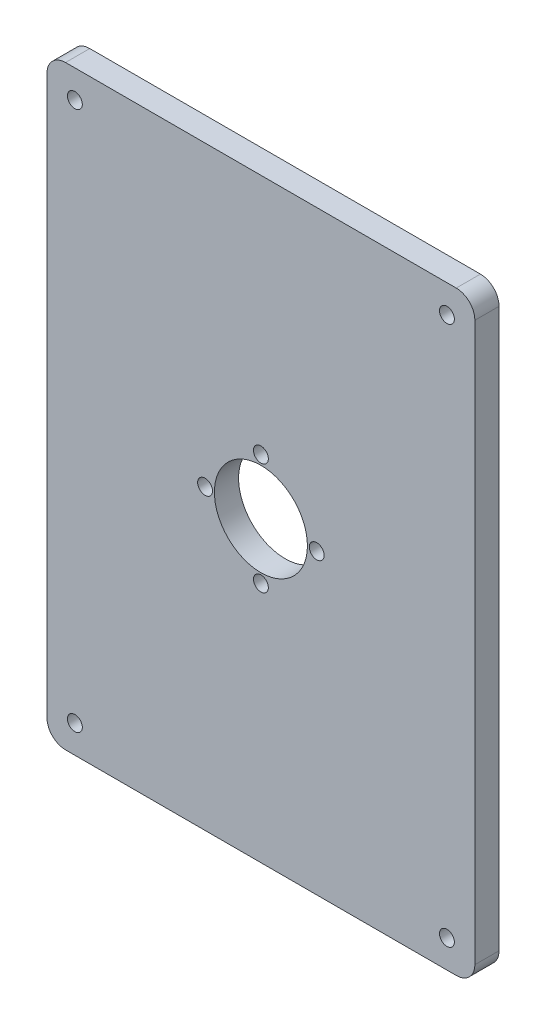
ISO-10303-21;
HEADER;
FILE_DESCRIPTION(('STEP AP214'),'2;1');
FILE_NAME('part.step','',(''),(''),'','','');
FILE_SCHEMA(('AUTOMOTIVE_DESIGN { 1 0 10303 214 1 1 1 1 }'));
ENDSEC;
DATA;
#1=APPLICATION_CONTEXT('core data for automotive mechanical design processes');
#2=APPLICATION_PROTOCOL_DEFINITION('international standard','automotive_design',2000,#1);
#3=PRODUCT_CONTEXT('',#1,'mechanical');
#4=PRODUCT('Part','Part','',(#3));
#5=PRODUCT_RELATED_PRODUCT_CATEGORY('part','',(#4));
#6=PRODUCT_DEFINITION_FORMATION('','',#4);
#7=PRODUCT_DEFINITION_CONTEXT('part definition',#1,'design');
#8=PRODUCT_DEFINITION('design','',#6,#7);
#9=PRODUCT_DEFINITION_SHAPE('','',#8);
#10=(LENGTH_UNIT() NAMED_UNIT(*) SI_UNIT(.MILLI.,.METRE.));
#11=(NAMED_UNIT(*) PLANE_ANGLE_UNIT() SI_UNIT($,.RADIAN.));
#12=(NAMED_UNIT(*) SI_UNIT($,.STERADIAN.) SOLID_ANGLE_UNIT());
#13=UNCERTAINTY_MEASURE_WITH_UNIT(LENGTH_MEASURE(1.E-05),#10,'distance_accuracy_value','');
#14=(GEOMETRIC_REPRESENTATION_CONTEXT(3) GLOBAL_UNCERTAINTY_ASSIGNED_CONTEXT((#13)) GLOBAL_UNIT_ASSIGNED_CONTEXT((#10,
#11,#12)) REPRESENTATION_CONTEXT('',''));
#15=CARTESIAN_POINT('',(0.,0.,0.));
#16=DIRECTION('',(0.,0.,1.));
#17=DIRECTION('',(1.,0.,0.));
#18=AXIS2_PLACEMENT_3D('',#15,#16,#17);
#19=CARTESIAN_POINT('',(105.,150.,13.));
#20=DIRECTION('',(0.,0.,-1.));
#21=DIRECTION('',(-1.,0.,0.));
#22=AXIS2_PLACEMENT_3D('',#19,#20,#21);
#23=PLANE('',#22);
#24=CARTESIAN_POINT('',(-30.,0.,13.));
#25=DIRECTION('',(0.,0.,1.));
#26=DIRECTION('',(1.,0.,0.));
#27=AXIS2_PLACEMENT_3D('',#24,#25,#26);
#28=CIRCLE('',#27,4.);
#29=CARTESIAN_POINT('',(-26.,0.,13.));
#30=VERTEX_POINT('',#29);
#31=EDGE_CURVE('E228',#30,#30,#28,.T.);
#32=ORIENTED_EDGE('',*,*,#31,.F.);
#33=EDGE_LOOP('',(#32));
#34=FACE_BOUND('',#33,.T.);
#35=CARTESIAN_POINT('',(0.,30.,13.));
#36=DIRECTION('',(0.,0.,1.));
#37=DIRECTION('',(1.,0.,0.));
#38=AXIS2_PLACEMENT_3D('',#35,#36,#37);
#39=CIRCLE('',#38,4.);
#40=CARTESIAN_POINT('',(4.,30.,13.));
#41=VERTEX_POINT('',#40);
#42=EDGE_CURVE('E225',#41,#41,#39,.T.);
#43=ORIENTED_EDGE('',*,*,#42,.F.);
#44=EDGE_LOOP('',(#43));
#45=FACE_BOUND('',#44,.T.);
#46=CARTESIAN_POINT('',(30.,0.,13.));
#47=DIRECTION('',(0.,0.,1.));
#48=DIRECTION('',(1.,0.,0.));
#49=AXIS2_PLACEMENT_3D('',#46,#47,#48);
#50=CIRCLE('',#49,4.00000000000001);
#51=CARTESIAN_POINT('',(34.,0.,13.));
#52=VERTEX_POINT('',#51);
#53=EDGE_CURVE('E219',#52,#52,#50,.T.);
#54=ORIENTED_EDGE('',*,*,#53,.F.);
#55=EDGE_LOOP('',(#54));
#56=FACE_BOUND('',#55,.T.);
#57=CARTESIAN_POINT('',(0.,-30.,13.));
#58=DIRECTION('',(0.,0.,1.));
#59=DIRECTION('',(1.,0.,0.));
#60=AXIS2_PLACEMENT_3D('',#57,#58,#59);
#61=CIRCLE('',#60,4.);
#62=CARTESIAN_POINT('',(4.,-30.,13.));
#63=VERTEX_POINT('',#62);
#64=EDGE_CURVE('E213',#63,#63,#61,.T.);
#65=ORIENTED_EDGE('',*,*,#64,.F.);
#66=EDGE_LOOP('',(#65));
#67=FACE_BOUND('',#66,.T.);
#68=CARTESIAN_POINT('',(0.,0.,13.));
#69=DIRECTION('',(0.,0.,1.));
#70=DIRECTION('',(1.,0.,0.));
#71=AXIS2_PLACEMENT_3D('',#68,#69,#70);
#72=CIRCLE('',#71,25.);
#73=CARTESIAN_POINT('',(25.,0.,13.));
#74=VERTEX_POINT('',#73);
#75=EDGE_CURVE('E204',#74,#74,#72,.T.);
#76=ORIENTED_EDGE('',*,*,#75,.F.);
#77=EDGE_LOOP('',(#76));
#78=FACE_BOUND('',#77,.T.);
#79=CARTESIAN_POINT('',(105.,150.,13.));
#80=DIRECTION('',(0.,0.,1.));
#81=DIRECTION('',(-1.,0.,0.));
#82=AXIS2_PLACEMENT_3D('',#79,#80,#81);
#83=CIRCLE('',#82,10.);
#84=CARTESIAN_POINT('',(115.,150.,13.));
#85=VERTEX_POINT('',#84);
#86=CARTESIAN_POINT('',(105.,160.,13.));
#87=VERTEX_POINT('',#86);
#88=EDGE_CURVE('E146',#85,#87,#83,.T.);
#89=ORIENTED_EDGE('',*,*,#88,.T.);
#90=DIRECTION('',(-1.,0.,0.));
#91=VECTOR('',#90,1.);
#92=CARTESIAN_POINT('',(-105.,160.,13.));
#93=LINE('',#92,#91);
#94=CARTESIAN_POINT('',(-105.,160.,13.));
#95=VERTEX_POINT('',#94);
#96=EDGE_CURVE('E94',#87,#95,#93,.T.);
#97=ORIENTED_EDGE('',*,*,#96,.T.);
#98=CARTESIAN_POINT('',(-105.,150.,13.));
#99=DIRECTION('',(0.,0.,1.));
#100=DIRECTION('',(1.,0.,0.));
#101=AXIS2_PLACEMENT_3D('',#98,#99,#100);
#102=CIRCLE('',#101,10.);
#103=CARTESIAN_POINT('',(-115.,150.,13.));
#104=VERTEX_POINT('',#103);
#105=EDGE_CURVE('E161',#95,#104,#102,.T.);
#106=ORIENTED_EDGE('',*,*,#105,.T.);
#107=DIRECTION('',(0.,-1.,0.));
#108=VECTOR('',#107,1.);
#109=CARTESIAN_POINT('',(-115.,150.,13.));
#110=LINE('',#109,#108);
#111=CARTESIAN_POINT('',(-115.,-150.,13.));
#112=VERTEX_POINT('',#111);
#113=EDGE_CURVE('E174',#104,#112,#110,.T.);
#114=ORIENTED_EDGE('',*,*,#113,.T.);
#115=CARTESIAN_POINT('',(-105.,-150.,13.));
#116=DIRECTION('',(0.,0.,1.));
#117=DIRECTION('',(1.,0.,0.));
#118=AXIS2_PLACEMENT_3D('',#115,#116,#117);
#119=CIRCLE('',#118,10.);
#120=CARTESIAN_POINT('',(-105.,-160.,13.));
#121=VERTEX_POINT('',#120);
#122=EDGE_CURVE('E113',#112,#121,#119,.T.);
#123=ORIENTED_EDGE('',*,*,#122,.T.);
#124=DIRECTION('',(1.,0.,0.));
#125=VECTOR('',#124,1.);
#126=CARTESIAN_POINT('',(-105.,-160.,13.));
#127=LINE('',#126,#125);
#128=CARTESIAN_POINT('',(105.,-160.,13.));
#129=VERTEX_POINT('',#128);
#130=EDGE_CURVE('E107',#121,#129,#127,.T.);
#131=ORIENTED_EDGE('',*,*,#130,.T.);
#132=CARTESIAN_POINT('',(105.,-150.,13.));
#133=DIRECTION('',(0.,0.,1.));
#134=DIRECTION('',(1.,0.,0.));
#135=AXIS2_PLACEMENT_3D('',#132,#133,#134);
#136=CIRCLE('',#135,10.);
#137=CARTESIAN_POINT('',(115.,-150.,13.));
#138=VERTEX_POINT('',#137);
#139=EDGE_CURVE('E111',#129,#138,#136,.T.);
#140=ORIENTED_EDGE('',*,*,#139,.T.);
#141=DIRECTION('',(0.,1.,0.));
#142=VECTOR('',#141,1.);
#143=CARTESIAN_POINT('',(115.,150.,13.));
#144=LINE('',#143,#142);
#145=EDGE_CURVE('E51',#138,#85,#144,.T.);
#146=ORIENTED_EDGE('',*,*,#145,.T.);
#147=EDGE_LOOP('',(#89,#97,#106,#114,#123,#131,#140,#146));
#148=FACE_BOUND('',#147,.T.);
#149=CARTESIAN_POINT('',(-100.,-145.,13.));
#150=DIRECTION('',(0.,0.,1.));
#151=DIRECTION('',(1.,0.,0.));
#152=AXIS2_PLACEMENT_3D('',#149,#150,#151);
#153=CIRCLE('',#152,4.00000000000001);
#154=CARTESIAN_POINT('',(-96.,-145.,13.));
#155=VERTEX_POINT('',#154);
#156=EDGE_CURVE('E135',#155,#155,#153,.T.);
#157=ORIENTED_EDGE('',*,*,#156,.F.);
#158=EDGE_LOOP('',(#157));
#159=FACE_BOUND('',#158,.T.);
#160=CARTESIAN_POINT('',(-100.,145.,13.));
#161=DIRECTION('',(0.,0.,1.));
#162=DIRECTION('',(1.,0.,0.));
#163=AXIS2_PLACEMENT_3D('',#160,#161,#162);
#164=CIRCLE('',#163,4.00000000000001);
#165=CARTESIAN_POINT('',(-96.,145.,13.));
#166=VERTEX_POINT('',#165);
#167=EDGE_CURVE('E183',#166,#166,#164,.T.);
#168=ORIENTED_EDGE('',*,*,#167,.F.);
#169=EDGE_LOOP('',(#168));
#170=FACE_BOUND('',#169,.T.);
#171=CARTESIAN_POINT('',(100.,-145.,13.));
#172=DIRECTION('',(0.,0.,1.));
#173=DIRECTION('',(1.,0.,0.));
#174=AXIS2_PLACEMENT_3D('',#171,#172,#173);
#175=CIRCLE('',#174,4.00000000000001);
#176=CARTESIAN_POINT('',(104.,-145.,13.));
#177=VERTEX_POINT('',#176);
#178=EDGE_CURVE('E189',#177,#177,#175,.T.);
#179=ORIENTED_EDGE('',*,*,#178,.F.);
#180=EDGE_LOOP('',(#179));
#181=FACE_BOUND('',#180,.T.);
#182=CARTESIAN_POINT('',(100.,145.,13.));
#183=DIRECTION('',(0.,0.,1.));
#184=DIRECTION('',(1.,0.,0.));
#185=AXIS2_PLACEMENT_3D('',#182,#183,#184);
#186=CIRCLE('',#185,4.00000000000001);
#187=CARTESIAN_POINT('',(104.,145.,13.));
#188=VERTEX_POINT('',#187);
#189=EDGE_CURVE('E195',#188,#188,#186,.T.);
#190=ORIENTED_EDGE('',*,*,#189,.F.);
#191=EDGE_LOOP('',(#190));
#192=FACE_BOUND('',#191,.T.);
#193=ADVANCED_FACE('F34',(#34,#45,#56,#67,#78,#148,#159,#170,#181,#192),#23,.F.);
#194=CARTESIAN_POINT('',(105.,150.,0.));
#195=DIRECTION('',(0.,0.,-1.));
#196=DIRECTION('',(-1.,0.,0.));
#197=AXIS2_PLACEMENT_3D('',#194,#195,#196);
#198=PLANE('',#197);
#199=CARTESIAN_POINT('',(-30.,0.,0.));
#200=DIRECTION('',(0.,0.,1.));
#201=DIRECTION('',(1.,0.,0.));
#202=AXIS2_PLACEMENT_3D('',#199,#200,#201);
#203=CIRCLE('',#202,4.);
#204=CARTESIAN_POINT('',(-26.,0.,0.));
#205=VERTEX_POINT('',#204);
#206=EDGE_CURVE('E207',#205,#205,#203,.T.);
#207=ORIENTED_EDGE('',*,*,#206,.T.);
#208=EDGE_LOOP('',(#207));
#209=FACE_BOUND('',#208,.T.);
#210=CARTESIAN_POINT('',(0.,30.,0.));
#211=DIRECTION('',(0.,0.,1.));
#212=DIRECTION('',(1.,0.,0.));
#213=AXIS2_PLACEMENT_3D('',#210,#211,#212);
#214=CIRCLE('',#213,4.);
#215=CARTESIAN_POINT('',(4.,30.,0.));
#216=VERTEX_POINT('',#215);
#217=EDGE_CURVE('E222',#216,#216,#214,.T.);
#218=ORIENTED_EDGE('',*,*,#217,.T.);
#219=EDGE_LOOP('',(#218));
#220=FACE_BOUND('',#219,.T.);
#221=CARTESIAN_POINT('',(30.,0.,0.));
#222=DIRECTION('',(0.,0.,1.));
#223=DIRECTION('',(1.,0.,0.));
#224=AXIS2_PLACEMENT_3D('',#221,#222,#223);
#225=CIRCLE('',#224,4.00000000000001);
#226=CARTESIAN_POINT('',(34.,0.,0.));
#227=VERTEX_POINT('',#226);
#228=EDGE_CURVE('E216',#227,#227,#225,.T.);
#229=ORIENTED_EDGE('',*,*,#228,.T.);
#230=EDGE_LOOP('',(#229));
#231=FACE_BOUND('',#230,.T.);
#232=CARTESIAN_POINT('',(0.,-30.,0.));
#233=DIRECTION('',(0.,0.,1.));
#234=DIRECTION('',(1.,0.,0.));
#235=AXIS2_PLACEMENT_3D('',#232,#233,#234);
#236=CIRCLE('',#235,4.);
#237=CARTESIAN_POINT('',(4.,-30.,0.));
#238=VERTEX_POINT('',#237);
#239=EDGE_CURVE('E210',#238,#238,#236,.T.);
#240=ORIENTED_EDGE('',*,*,#239,.T.);
#241=EDGE_LOOP('',(#240));
#242=FACE_BOUND('',#241,.T.);
#243=CARTESIAN_POINT('',(0.,0.,0.));
#244=DIRECTION('',(0.,0.,1.));
#245=DIRECTION('',(1.,0.,0.));
#246=AXIS2_PLACEMENT_3D('',#243,#244,#245);
#247=CIRCLE('',#246,25.);
#248=CARTESIAN_POINT('',(25.,0.,0.));
#249=VERTEX_POINT('',#248);
#250=EDGE_CURVE('E201',#249,#249,#247,.T.);
#251=ORIENTED_EDGE('',*,*,#250,.T.);
#252=EDGE_LOOP('',(#251));
#253=FACE_BOUND('',#252,.T.);
#254=CARTESIAN_POINT('',(100.,-145.,0.));
#255=DIRECTION('',(0.,0.,1.));
#256=DIRECTION('',(1.,0.,0.));
#257=AXIS2_PLACEMENT_3D('',#254,#255,#256);
#258=CIRCLE('',#257,4.00000000000001);
#259=CARTESIAN_POINT('',(104.,-145.,0.));
#260=VERTEX_POINT('',#259);
#261=EDGE_CURVE('E192',#260,#260,#258,.T.);
#262=ORIENTED_EDGE('',*,*,#261,.T.);
#263=EDGE_LOOP('',(#262));
#264=FACE_BOUND('',#263,.T.);
#265=CARTESIAN_POINT('',(-100.,-145.,0.));
#266=DIRECTION('',(0.,0.,1.));
#267=DIRECTION('',(1.,0.,0.));
#268=AXIS2_PLACEMENT_3D('',#265,#266,#267);
#269=CIRCLE('',#268,4.00000000000001);
#270=CARTESIAN_POINT('',(-96.,-145.,0.));
#271=VERTEX_POINT('',#270);
#272=EDGE_CURVE('E180',#271,#271,#269,.T.);
#273=ORIENTED_EDGE('',*,*,#272,.T.);
#274=EDGE_LOOP('',(#273));
#275=FACE_BOUND('',#274,.T.);
#276=CARTESIAN_POINT('',(105.,150.,0.));
#277=DIRECTION('',(0.,0.,1.));
#278=DIRECTION('',(-1.,0.,0.));
#279=AXIS2_PLACEMENT_3D('',#276,#277,#278);
#280=CIRCLE('',#279,10.);
#281=CARTESIAN_POINT('',(115.,150.,0.));
#282=VERTEX_POINT('',#281);
#283=CARTESIAN_POINT('',(105.,160.,0.));
#284=VERTEX_POINT('',#283);
#285=EDGE_CURVE('E131',#282,#284,#280,.T.);
#286=ORIENTED_EDGE('',*,*,#285,.F.);
#287=DIRECTION('',(0.,1.,0.));
#288=VECTOR('',#287,1.);
#289=CARTESIAN_POINT('',(115.,150.,0.));
#290=LINE('',#289,#288);
#291=CARTESIAN_POINT('',(115.,-150.,0.));
#292=VERTEX_POINT('',#291);
#293=EDGE_CURVE('E86',#292,#282,#290,.T.);
#294=ORIENTED_EDGE('',*,*,#293,.F.);
#295=CARTESIAN_POINT('',(105.,-150.,0.));
#296=DIRECTION('',(0.,0.,1.));
#297=DIRECTION('',(1.,0.,0.));
#298=AXIS2_PLACEMENT_3D('',#295,#296,#297);
#299=CIRCLE('',#298,10.);
#300=CARTESIAN_POINT('',(105.,-160.,0.));
#301=VERTEX_POINT('',#300);
#302=EDGE_CURVE('E80',#301,#292,#299,.T.);
#303=ORIENTED_EDGE('',*,*,#302,.F.);
#304=DIRECTION('',(1.,0.,0.));
#305=VECTOR('',#304,1.);
#306=CARTESIAN_POINT('',(-105.,-160.,0.));
#307=LINE('',#306,#305);
#308=CARTESIAN_POINT('',(-105.,-160.,0.));
#309=VERTEX_POINT('',#308);
#310=EDGE_CURVE('E121',#309,#301,#307,.T.);
#311=ORIENTED_EDGE('',*,*,#310,.F.);
#312=CARTESIAN_POINT('',(-105.,-150.,0.));
#313=DIRECTION('',(0.,0.,1.));
#314=DIRECTION('',(1.,0.,0.));
#315=AXIS2_PLACEMENT_3D('',#312,#313,#314);
#316=CIRCLE('',#315,10.);
#317=CARTESIAN_POINT('',(-115.,-150.,0.));
#318=VERTEX_POINT('',#317);
#319=EDGE_CURVE('E141',#318,#309,#316,.T.);
#320=ORIENTED_EDGE('',*,*,#319,.F.);
#321=DIRECTION('',(0.,-1.,0.));
#322=VECTOR('',#321,1.);
#323=CARTESIAN_POINT('',(-115.,150.,0.));
#324=LINE('',#323,#322);
#325=CARTESIAN_POINT('',(-115.,150.,0.));
#326=VERTEX_POINT('',#325);
#327=EDGE_CURVE('E139',#326,#318,#324,.T.);
#328=ORIENTED_EDGE('',*,*,#327,.F.);
#329=CARTESIAN_POINT('',(-105.,150.,0.));
#330=DIRECTION('',(0.,0.,1.));
#331=DIRECTION('',(1.,0.,0.));
#332=AXIS2_PLACEMENT_3D('',#329,#330,#331);
#333=CIRCLE('',#332,10.);
#334=CARTESIAN_POINT('',(-105.,160.,0.));
#335=VERTEX_POINT('',#334);
#336=EDGE_CURVE('E137',#335,#326,#333,.T.);
#337=ORIENTED_EDGE('',*,*,#336,.F.);
#338=DIRECTION('',(-1.,0.,0.));
#339=VECTOR('',#338,1.);
#340=CARTESIAN_POINT('',(-105.,160.,0.));
#341=LINE('',#340,#339);
#342=EDGE_CURVE('E134',#284,#335,#341,.T.);
#343=ORIENTED_EDGE('',*,*,#342,.F.);
#344=EDGE_LOOP('',(#286,#294,#303,#311,#320,#328,#337,#343));
#345=FACE_BOUND('',#344,.T.);
#346=CARTESIAN_POINT('',(-100.,145.,0.));
#347=DIRECTION('',(0.,0.,1.));
#348=DIRECTION('',(1.,0.,0.));
#349=AXIS2_PLACEMENT_3D('',#346,#347,#348);
#350=CIRCLE('',#349,4.00000000000001);
#351=CARTESIAN_POINT('',(-96.,145.,0.));
#352=VERTEX_POINT('',#351);
#353=EDGE_CURVE('E186',#352,#352,#350,.T.);
#354=ORIENTED_EDGE('',*,*,#353,.T.);
#355=EDGE_LOOP('',(#354));
#356=FACE_BOUND('',#355,.T.);
#357=CARTESIAN_POINT('',(100.,145.,0.));
#358=DIRECTION('',(0.,0.,1.));
#359=DIRECTION('',(1.,0.,0.));
#360=AXIS2_PLACEMENT_3D('',#357,#358,#359);
#361=CIRCLE('',#360,4.00000000000001);
#362=CARTESIAN_POINT('',(104.,145.,0.));
#363=VERTEX_POINT('',#362);
#364=EDGE_CURVE('E198',#363,#363,#361,.T.);
#365=ORIENTED_EDGE('',*,*,#364,.T.);
#366=EDGE_LOOP('',(#365));
#367=FACE_BOUND('',#366,.T.);
#368=ADVANCED_FACE('F165',(#209,#220,#231,#242,#253,#264,#275,#345,#356,#367),#198,.T.);
#369=CARTESIAN_POINT('',(105.,150.,13.));
#370=DIRECTION('',(0.,0.,-1.));
#371=DIRECTION('',(-1.,0.,0.));
#372=AXIS2_PLACEMENT_3D('',#369,#370,#371);
#373=CYLINDRICAL_SURFACE('',#372,10.);
#374=ORIENTED_EDGE('',*,*,#285,.T.);
#375=DIRECTION('',(0.,0.,-1.));
#376=VECTOR('',#375,1.);
#377=CARTESIAN_POINT('',(105.,160.,13.));
#378=LINE('',#377,#376);
#379=EDGE_CURVE('E11',#87,#284,#378,.T.);
#380=ORIENTED_EDGE('',*,*,#379,.F.);
#381=ORIENTED_EDGE('',*,*,#88,.F.);
#382=DIRECTION('',(0.,0.,-1.));
#383=VECTOR('',#382,1.);
#384=CARTESIAN_POINT('',(115.,150.,13.));
#385=LINE('',#384,#383);
#386=EDGE_CURVE('E127',#85,#282,#385,.T.);
#387=ORIENTED_EDGE('',*,*,#386,.T.);
#388=EDGE_LOOP('',(#374,#380,#381,#387));
#389=FACE_BOUND('',#388,.T.);
#390=ADVANCED_FACE('F36',(#389),#373,.T.);
#391=CARTESIAN_POINT('',(-105.,160.,13.));
#392=DIRECTION('',(0.,-1.,0.));
#393=DIRECTION('',(0.,0.,-1.));
#394=AXIS2_PLACEMENT_3D('',#391,#392,#393);
#395=PLANE('',#394);
#396=ORIENTED_EDGE('',*,*,#342,.T.);
#397=DIRECTION('',(0.,0.,-1.));
#398=VECTOR('',#397,1.);
#399=CARTESIAN_POINT('',(-105.,160.,13.));
#400=LINE('',#399,#398);
#401=EDGE_CURVE('E43',#95,#335,#400,.T.);
#402=ORIENTED_EDGE('',*,*,#401,.F.);
#403=ORIENTED_EDGE('',*,*,#96,.F.);
#404=ORIENTED_EDGE('',*,*,#379,.T.);
#405=EDGE_LOOP('',(#396,#402,#403,#404));
#406=FACE_BOUND('',#405,.T.);
#407=ADVANCED_FACE('F298',(#406),#395,.F.);
#408=CARTESIAN_POINT('',(-105.,150.,13.));
#409=DIRECTION('',(0.,0.,-1.));
#410=DIRECTION('',(-1.,0.,0.));
#411=AXIS2_PLACEMENT_3D('',#408,#409,#410);
#412=CYLINDRICAL_SURFACE('',#411,10.);
#413=ORIENTED_EDGE('',*,*,#336,.T.);
#414=DIRECTION('',(0.,0.,-1.));
#415=VECTOR('',#414,1.);
#416=CARTESIAN_POINT('',(-115.,150.,13.));
#417=LINE('',#416,#415);
#418=EDGE_CURVE('E153',#104,#326,#417,.T.);
#419=ORIENTED_EDGE('',*,*,#418,.F.);
#420=ORIENTED_EDGE('',*,*,#105,.F.);
#421=ORIENTED_EDGE('',*,*,#401,.T.);
#422=EDGE_LOOP('',(#413,#419,#420,#421));
#423=FACE_BOUND('',#422,.T.);
#424=ADVANCED_FACE('F159',(#423),#412,.T.);
#425=CARTESIAN_POINT('',(-115.,150.,13.));
#426=DIRECTION('',(1.,0.,0.));
#427=DIRECTION('',(0.,1.,0.));
#428=AXIS2_PLACEMENT_3D('',#425,#426,#427);
#429=PLANE('',#428);
#430=ORIENTED_EDGE('',*,*,#327,.T.);
#431=DIRECTION('',(0.,0.,-1.));
#432=VECTOR('',#431,1.);
#433=CARTESIAN_POINT('',(-115.,-150.,13.));
#434=LINE('',#433,#432);
#435=EDGE_CURVE('E150',#112,#318,#434,.T.);
#436=ORIENTED_EDGE('',*,*,#435,.F.);
#437=ORIENTED_EDGE('',*,*,#113,.F.);
#438=ORIENTED_EDGE('',*,*,#418,.T.);
#439=EDGE_LOOP('',(#430,#436,#437,#438));
#440=FACE_BOUND('',#439,.T.);
#441=ADVANCED_FACE('F170',(#440),#429,.F.);
#442=CARTESIAN_POINT('',(-105.,-150.,13.));
#443=DIRECTION('',(0.,0.,-1.));
#444=DIRECTION('',(-1.,0.,0.));
#445=AXIS2_PLACEMENT_3D('',#442,#443,#444);
#446=CYLINDRICAL_SURFACE('',#445,10.);
#447=ORIENTED_EDGE('',*,*,#319,.T.);
#448=DIRECTION('',(0.,0.,-1.));
#449=VECTOR('',#448,1.);
#450=CARTESIAN_POINT('',(-105.,-160.,13.));
#451=LINE('',#450,#449);
#452=EDGE_CURVE('E122',#121,#309,#451,.T.);
#453=ORIENTED_EDGE('',*,*,#452,.F.);
#454=ORIENTED_EDGE('',*,*,#122,.F.);
#455=ORIENTED_EDGE('',*,*,#435,.T.);
#456=EDGE_LOOP('',(#447,#453,#454,#455));
#457=FACE_BOUND('',#456,.T.);
#458=ADVANCED_FACE('F173',(#457),#446,.T.);
#459=CARTESIAN_POINT('',(-105.,-160.,13.));
#460=DIRECTION('',(0.,1.,0.));
#461=DIRECTION('',(0.,0.,1.));
#462=AXIS2_PLACEMENT_3D('',#459,#460,#461);
#463=PLANE('',#462);
#464=ORIENTED_EDGE('',*,*,#310,.T.);
#465=DIRECTION('',(0.,0.,-1.));
#466=VECTOR('',#465,1.);
#467=CARTESIAN_POINT('',(105.,-160.,13.));
#468=LINE('',#467,#466);
#469=EDGE_CURVE('E118',#129,#301,#468,.T.);
#470=ORIENTED_EDGE('',*,*,#469,.F.);
#471=ORIENTED_EDGE('',*,*,#130,.F.);
#472=ORIENTED_EDGE('',*,*,#452,.T.);
#473=EDGE_LOOP('',(#464,#470,#471,#472));
#474=FACE_BOUND('',#473,.T.);
#475=ADVANCED_FACE('F119',(#474),#463,.F.);
#476=CARTESIAN_POINT('',(105.,-150.,13.));
#477=DIRECTION('',(0.,0.,-1.));
#478=DIRECTION('',(-1.,0.,0.));
#479=AXIS2_PLACEMENT_3D('',#476,#477,#478);
#480=CYLINDRICAL_SURFACE('',#479,10.);
#481=ORIENTED_EDGE('',*,*,#302,.T.);
#482=DIRECTION('',(0.,0.,-1.));
#483=VECTOR('',#482,1.);
#484=CARTESIAN_POINT('',(115.,-150.,13.));
#485=LINE('',#484,#483);
#486=EDGE_CURVE('E123',#138,#292,#485,.T.);
#487=ORIENTED_EDGE('',*,*,#486,.F.);
#488=ORIENTED_EDGE('',*,*,#139,.F.);
#489=ORIENTED_EDGE('',*,*,#469,.T.);
#490=EDGE_LOOP('',(#481,#487,#488,#489));
#491=FACE_BOUND('',#490,.T.);
#492=ADVANCED_FACE('F125',(#491),#480,.T.);
#493=CARTESIAN_POINT('',(115.,150.,13.));
#494=DIRECTION('',(-1.,0.,0.));
#495=DIRECTION('',(0.,-1.,0.));
#496=AXIS2_PLACEMENT_3D('',#493,#494,#495);
#497=PLANE('',#496);
#498=ORIENTED_EDGE('',*,*,#293,.T.);
#499=ORIENTED_EDGE('',*,*,#386,.F.);
#500=ORIENTED_EDGE('',*,*,#145,.F.);
#501=ORIENTED_EDGE('',*,*,#486,.T.);
#502=EDGE_LOOP('',(#498,#499,#500,#501));
#503=FACE_BOUND('',#502,.T.);
#504=ADVANCED_FACE('F282',(#503),#497,.F.);
#505=CARTESIAN_POINT('',(-100.,-145.,13.));
#506=DIRECTION('',(0.,0.,-1.));
#507=DIRECTION('',(-1.,0.,0.));
#508=AXIS2_PLACEMENT_3D('',#505,#506,#507);
#509=CYLINDRICAL_SURFACE('',#508,4.00000000000001);
#510=ORIENTED_EDGE('',*,*,#156,.T.);
#511=EDGE_LOOP('',(#510));
#512=FACE_BOUND('',#511,.T.);
#513=ORIENTED_EDGE('',*,*,#272,.F.);
#514=EDGE_LOOP('',(#513));
#515=FACE_BOUND('',#514,.T.);
#516=ADVANCED_FACE('F279',(#512,#515),#509,.F.);
#517=CARTESIAN_POINT('',(-100.,145.,13.));
#518=DIRECTION('',(0.,0.,-1.));
#519=DIRECTION('',(-1.,0.,0.));
#520=AXIS2_PLACEMENT_3D('',#517,#518,#519);
#521=CYLINDRICAL_SURFACE('',#520,4.00000000000001);
#522=ORIENTED_EDGE('',*,*,#167,.T.);
#523=EDGE_LOOP('',(#522));
#524=FACE_BOUND('',#523,.T.);
#525=ORIENTED_EDGE('',*,*,#353,.F.);
#526=EDGE_LOOP('',(#525));
#527=FACE_BOUND('',#526,.T.);
#528=ADVANCED_FACE('F275',(#524,#527),#521,.F.);
#529=CARTESIAN_POINT('',(100.,-145.,13.));
#530=DIRECTION('',(0.,0.,-1.));
#531=DIRECTION('',(-1.,0.,0.));
#532=AXIS2_PLACEMENT_3D('',#529,#530,#531);
#533=CYLINDRICAL_SURFACE('',#532,4.00000000000001);
#534=ORIENTED_EDGE('',*,*,#178,.T.);
#535=EDGE_LOOP('',(#534));
#536=FACE_BOUND('',#535,.T.);
#537=ORIENTED_EDGE('',*,*,#261,.F.);
#538=EDGE_LOOP('',(#537));
#539=FACE_BOUND('',#538,.T.);
#540=ADVANCED_FACE('F267',(#536,#539),#533,.F.);
#541=CARTESIAN_POINT('',(100.,145.,13.));
#542=DIRECTION('',(0.,0.,-1.));
#543=DIRECTION('',(-1.,0.,0.));
#544=AXIS2_PLACEMENT_3D('',#541,#542,#543);
#545=CYLINDRICAL_SURFACE('',#544,4.00000000000001);
#546=ORIENTED_EDGE('',*,*,#189,.T.);
#547=EDGE_LOOP('',(#546));
#548=FACE_BOUND('',#547,.T.);
#549=ORIENTED_EDGE('',*,*,#364,.F.);
#550=EDGE_LOOP('',(#549));
#551=FACE_BOUND('',#550,.T.);
#552=ADVANCED_FACE('F257',(#548,#551),#545,.F.);
#553=CARTESIAN_POINT('',(0.,0.,0.));
#554=DIRECTION('',(0.,0.,1.));
#555=DIRECTION('',(1.,0.,0.));
#556=AXIS2_PLACEMENT_3D('',#553,#554,#555);
#557=CYLINDRICAL_SURFACE('',#556,25.);
#558=ORIENTED_EDGE('',*,*,#250,.F.);
#559=EDGE_LOOP('',(#558));
#560=FACE_BOUND('',#559,.T.);
#561=ORIENTED_EDGE('',*,*,#75,.T.);
#562=EDGE_LOOP('',(#561));
#563=FACE_BOUND('',#562,.T.);
#564=ADVANCED_FACE('F254',(#560,#563),#557,.F.);
#565=CARTESIAN_POINT('',(0.,-30.,0.));
#566=DIRECTION('',(0.,0.,1.));
#567=DIRECTION('',(1.,0.,0.));
#568=AXIS2_PLACEMENT_3D('',#565,#566,#567);
#569=CYLINDRICAL_SURFACE('',#568,4.);
#570=ORIENTED_EDGE('',*,*,#239,.F.);
#571=EDGE_LOOP('',(#570));
#572=FACE_BOUND('',#571,.T.);
#573=ORIENTED_EDGE('',*,*,#64,.T.);
#574=EDGE_LOOP('',(#573));
#575=FACE_BOUND('',#574,.T.);
#576=ADVANCED_FACE('F256',(#572,#575),#569,.F.);
#577=CARTESIAN_POINT('',(30.,0.,0.));
#578=DIRECTION('',(0.,0.,1.));
#579=DIRECTION('',(1.,0.,0.));
#580=AXIS2_PLACEMENT_3D('',#577,#578,#579);
#581=CYLINDRICAL_SURFACE('',#580,4.00000000000001);
#582=ORIENTED_EDGE('',*,*,#228,.F.);
#583=EDGE_LOOP('',(#582));
#584=FACE_BOUND('',#583,.T.);
#585=ORIENTED_EDGE('',*,*,#53,.T.);
#586=EDGE_LOOP('',(#585));
#587=FACE_BOUND('',#586,.T.);
#588=ADVANCED_FACE('F264',(#584,#587),#581,.F.);
#589=CARTESIAN_POINT('',(0.,30.,0.));
#590=DIRECTION('',(0.,0.,1.));
#591=DIRECTION('',(1.,0.,0.));
#592=AXIS2_PLACEMENT_3D('',#589,#590,#591);
#593=CYLINDRICAL_SURFACE('',#592,4.);
#594=ORIENTED_EDGE('',*,*,#217,.F.);
#595=EDGE_LOOP('',(#594));
#596=FACE_BOUND('',#595,.T.);
#597=ORIENTED_EDGE('',*,*,#42,.T.);
#598=EDGE_LOOP('',(#597));
#599=FACE_BOUND('',#598,.T.);
#600=ADVANCED_FACE('F239',(#596,#599),#593,.F.);
#601=CARTESIAN_POINT('',(-30.,0.,0.));
#602=DIRECTION('',(0.,0.,1.));
#603=DIRECTION('',(1.,0.,0.));
#604=AXIS2_PLACEMENT_3D('',#601,#602,#603);
#605=CYLINDRICAL_SURFACE('',#604,4.);
#606=ORIENTED_EDGE('',*,*,#206,.F.);
#607=EDGE_LOOP('',(#606));
#608=FACE_BOUND('',#607,.T.);
#609=ORIENTED_EDGE('',*,*,#31,.T.);
#610=EDGE_LOOP('',(#609));
#611=FACE_BOUND('',#610,.T.);
#612=ADVANCED_FACE('F236',(#608,#611),#605,.F.);
#613=CLOSED_SHELL('',(#193,#368,#390,#407,#424,#441,#458,#475,#492,#504,#516,#528,#540,#552,
#564,#576,#588,#600,#612));
#614=MANIFOLD_SOLID_BREP('B2',#613);
#615=ADVANCED_BREP_SHAPE_REPRESENTATION('',(#18,#614),#14);
#616=SHAPE_DEFINITION_REPRESENTATION(#9,#615);
ENDSEC;
END-ISO-10303-21;
